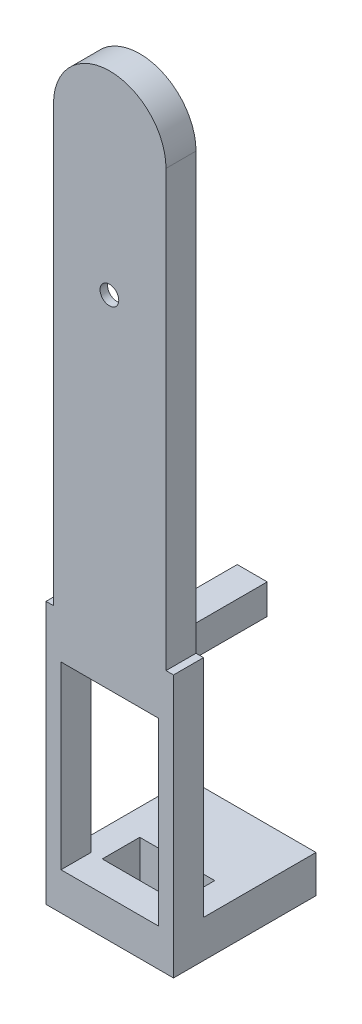
ISO-10303-21;
HEADER;
FILE_DESCRIPTION(('STEP AP214'),'2;1');
FILE_NAME('part.step','',(''),(''),'','','');
FILE_SCHEMA(('AUTOMOTIVE_DESIGN { 1 0 10303 214 1 1 1 1 }'));
ENDSEC;
DATA;
#1=APPLICATION_CONTEXT('core data for automotive mechanical design processes');
#2=APPLICATION_PROTOCOL_DEFINITION('international standard','automotive_design',2000,#1);
#3=PRODUCT_CONTEXT('',#1,'mechanical');
#4=PRODUCT('Part','Part','',(#3));
#5=PRODUCT_RELATED_PRODUCT_CATEGORY('part','',(#4));
#6=PRODUCT_DEFINITION_FORMATION('','',#4);
#7=PRODUCT_DEFINITION_CONTEXT('part definition',#1,'design');
#8=PRODUCT_DEFINITION('design','',#6,#7);
#9=PRODUCT_DEFINITION_SHAPE('','',#8);
#10=(LENGTH_UNIT() NAMED_UNIT(*) SI_UNIT(.MILLI.,.METRE.));
#11=(NAMED_UNIT(*) PLANE_ANGLE_UNIT() SI_UNIT($,.RADIAN.));
#12=(NAMED_UNIT(*) SI_UNIT($,.STERADIAN.) SOLID_ANGLE_UNIT());
#13=UNCERTAINTY_MEASURE_WITH_UNIT(LENGTH_MEASURE(1.E-05),#10,'distance_accuracy_value','');
#14=(GEOMETRIC_REPRESENTATION_CONTEXT(3) GLOBAL_UNCERTAINTY_ASSIGNED_CONTEXT((#13)) GLOBAL_UNIT_ASSIGNED_CONTEXT((#10,
#11,#12)) REPRESENTATION_CONTEXT('',''));
#15=CARTESIAN_POINT('',(0.,0.,0.));
#16=DIRECTION('',(0.,0.,1.));
#17=DIRECTION('',(1.,0.,0.));
#18=AXIS2_PLACEMENT_3D('',#15,#16,#17);
#19=CARTESIAN_POINT('',(0.,58.,0.));
#20=DIRECTION('',(0.,0.,1.));
#21=DIRECTION('',(1.,0.,0.));
#22=AXIS2_PLACEMENT_3D('',#19,#20,#21);
#23=PLANE('',#22);
#24=DIRECTION('',(0.,1.,0.));
#25=VECTOR('',#24,1.);
#26=CARTESIAN_POINT('',(8.50000000000001,0.,0.));
#27=LINE('',#26,#25);
#28=CARTESIAN_POINT('',(8.50000000000001,-30.,0.));
#29=VERTEX_POINT('',#28);
#30=CARTESIAN_POINT('',(8.50000000000001,0.,0.));
#31=VERTEX_POINT('',#30);
#32=EDGE_CURVE('E67',#29,#31,#27,.T.);
#33=ORIENTED_EDGE('',*,*,#32,.F.);
#34=DIRECTION('',(1.,0.,0.));
#35=VECTOR('',#34,1.);
#36=CARTESIAN_POINT('',(0.,-30.,0.));
#37=LINE('',#36,#35);
#38=CARTESIAN_POINT('',(6.50000000000001,-30.,0.));
#39=VERTEX_POINT('',#38);
#40=EDGE_CURVE('E320',#39,#29,#37,.T.);
#41=ORIENTED_EDGE('',*,*,#40,.F.);
#42=DIRECTION('',(0.,1.,0.));
#43=VECTOR('',#42,1.);
#44=CARTESIAN_POINT('',(6.50000000000001,-6.,0.));
#45=LINE('',#44,#43);
#46=CARTESIAN_POINT('',(6.50000000000001,-6.,0.));
#47=VERTEX_POINT('',#46);
#48=EDGE_CURVE('E426',#39,#47,#45,.T.);
#49=ORIENTED_EDGE('',*,*,#48,.T.);
#50=DIRECTION('',(-1.,0.,0.));
#51=VECTOR('',#50,1.);
#52=CARTESIAN_POINT('',(-6.49999999999999,-6.,0.));
#53=LINE('',#52,#51);
#54=CARTESIAN_POINT('',(2.00000000000001,-6.00000000000001,0.));
#55=VERTEX_POINT('',#54);
#56=EDGE_CURVE('E431',#47,#55,#53,.T.);
#57=ORIENTED_EDGE('',*,*,#56,.T.);
#58=DIRECTION('',(0.,1.,0.));
#59=VECTOR('',#58,1.);
#60=CARTESIAN_POINT('',(2.00000000000001,-2.00000000000001,0.));
#61=LINE('',#60,#59);
#62=CARTESIAN_POINT('',(2.00000000000001,-2.00000000000001,0.));
#63=VERTEX_POINT('',#62);
#64=EDGE_CURVE('E378',#55,#63,#61,.T.);
#65=ORIENTED_EDGE('',*,*,#64,.T.);
#66=DIRECTION('',(-1.,0.,0.));
#67=VECTOR('',#66,1.);
#68=CARTESIAN_POINT('',(2.00000000000001,-2.00000000000001,0.));
#69=LINE('',#68,#67);
#70=CARTESIAN_POINT('',(-1.99999999999999,-2.00000000000001,0.));
#71=VERTEX_POINT('',#70);
#72=EDGE_CURVE('E401',#63,#71,#69,.T.);
#73=ORIENTED_EDGE('',*,*,#72,.T.);
#74=DIRECTION('',(0.,-1.,0.));
#75=VECTOR('',#74,1.);
#76=CARTESIAN_POINT('',(-1.99999999999999,-2.00000000000001,0.));
#77=LINE('',#76,#75);
#78=CARTESIAN_POINT('',(-1.99999999999999,-6.,0.));
#79=VERTEX_POINT('',#78);
#80=EDGE_CURVE('E385',#71,#79,#77,.T.);
#81=ORIENTED_EDGE('',*,*,#80,.T.);
#82=CARTESIAN_POINT('',(-6.49999999999999,-6.,0.));
#83=VERTEX_POINT('',#82);
#84=EDGE_CURVE('E430',#79,#83,#53,.T.);
#85=ORIENTED_EDGE('',*,*,#84,.T.);
#86=DIRECTION('',(0.,-1.,0.));
#87=VECTOR('',#86,1.);
#88=CARTESIAN_POINT('',(-6.49999999999999,-6.,0.));
#89=LINE('',#88,#87);
#90=CARTESIAN_POINT('',(-6.49999999999999,-30.,0.));
#91=VERTEX_POINT('',#90);
#92=EDGE_CURVE('E411',#83,#91,#89,.T.);
#93=ORIENTED_EDGE('',*,*,#92,.T.);
#94=DIRECTION('',(1.,0.,0.));
#95=VECTOR('',#94,1.);
#96=CARTESIAN_POINT('',(0.,-30.,0.));
#97=LINE('',#96,#95);
#98=CARTESIAN_POINT('',(-8.49999999999999,-30.,0.));
#99=VERTEX_POINT('',#98);
#100=EDGE_CURVE('E333',#99,#91,#97,.T.);
#101=ORIENTED_EDGE('',*,*,#100,.F.);
#102=DIRECTION('',(0.,-1.,0.));
#103=VECTOR('',#102,1.);
#104=CARTESIAN_POINT('',(-8.49999999999999,0.,0.));
#105=LINE('',#104,#103);
#106=CARTESIAN_POINT('',(-8.49999999999999,0.,0.));
#107=VERTEX_POINT('',#106);
#108=EDGE_CURVE('E489',#107,#99,#105,.T.);
#109=ORIENTED_EDGE('',*,*,#108,.F.);
#110=DIRECTION('',(-1.,0.,0.));
#111=VECTOR('',#110,1.);
#112=CARTESIAN_POINT('',(8.50000000000001,0.,0.));
#113=LINE('',#112,#111);
#114=CARTESIAN_POINT('',(-7.5,0.,0.));
#115=VERTEX_POINT('',#114);
#116=EDGE_CURVE('E484',#115,#107,#113,.T.);
#117=ORIENTED_EDGE('',*,*,#116,.F.);
#118=DIRECTION('',(0.,-1.,0.));
#119=VECTOR('',#118,1.);
#120=CARTESIAN_POINT('',(-7.5,0.,0.));
#121=LINE('',#120,#119);
#122=CARTESIAN_POINT('',(-7.5,58.,0.));
#123=VERTEX_POINT('',#122);
#124=EDGE_CURVE('E514',#123,#115,#121,.T.);
#125=ORIENTED_EDGE('',*,*,#124,.F.);
#126=CARTESIAN_POINT('',(0.,58.,0.));
#127=DIRECTION('',(0.,0.,1.));
#128=DIRECTION('',(1.,0.,0.));
#129=AXIS2_PLACEMENT_3D('',#126,#127,#128);
#130=CIRCLE('',#129,7.5);
#131=CARTESIAN_POINT('',(7.5,58.,0.));
#132=VERTEX_POINT('',#131);
#133=EDGE_CURVE('E523',#132,#123,#130,.T.);
#134=ORIENTED_EDGE('',*,*,#133,.F.);
#135=DIRECTION('',(0.,1.,0.));
#136=VECTOR('',#135,1.);
#137=CARTESIAN_POINT('',(7.5,0.,0.));
#138=LINE('',#137,#136);
#139=CARTESIAN_POINT('',(7.5,0.,0.));
#140=VERTEX_POINT('',#139);
#141=EDGE_CURVE('E509',#140,#132,#138,.T.);
#142=ORIENTED_EDGE('',*,*,#141,.F.);
#143=EDGE_CURVE('E485',#31,#140,#113,.T.);
#144=ORIENTED_EDGE('',*,*,#143,.F.);
#145=EDGE_LOOP('',(#33,#41,#49,#57,#65,#73,#81,#85,#93,#101,#109,#117,#125,#134,#142,#144));
#146=FACE_BOUND('',#145,.T.);
#147=DIRECTION('',(0.143172187649809,-0.989697794623979,0.));
#148=VECTOR('',#147,1.);
#149=CARTESIAN_POINT('',(-5.04981595542474,39.6042352095294,0.));
#150=LINE('',#149,#148);
#151=CARTESIAN_POINT('',(-5.04981595542474,39.6042352095294,0.));
#152=VERTEX_POINT('',#151);
#153=CARTESIAN_POINT('',(-2.47072211778602,21.7758879226761,0.));
#154=VERTEX_POINT('',#153);
#155=EDGE_CURVE('E59',#152,#154,#150,.T.);
#156=ORIENTED_EDGE('',*,*,#155,.T.);
#157=CARTESIAN_POINT('',(-0.200975521021717,22.1042352095293,0.));
#158=DIRECTION('',(0.,0.,-1.));
#159=DIRECTION('',(-1.,0.,0.));
#160=AXIS2_PLACEMENT_3D('',#157,#158,#159);
#161=CIRCLE('',#160,2.29337340054058);
#162=CARTESIAN_POINT('',(2.09239787951886,22.1042352095293,0.));
#163=VERTEX_POINT('',#162);
#164=EDGE_CURVE('E247',#163,#154,#161,.T.);
#165=ORIENTED_EDGE('',*,*,#164,.F.);
#166=DIRECTION('',(-0.161167236733303,-0.986927110684346,0.));
#167=VECTOR('',#166,1.);
#168=CARTESIAN_POINT('',(4.95018404457524,39.6042352095293,0.));
#169=LINE('',#168,#167);
#170=CARTESIAN_POINT('',(4.95018404457524,39.6042352095293,0.));
#171=VERTEX_POINT('',#170);
#172=EDGE_CURVE('E276',#171,#163,#169,.T.);
#173=ORIENTED_EDGE('',*,*,#172,.F.);
#174=DIRECTION('',(0.161684528353419,-0.986842496699008,0.));
#175=VECTOR('',#174,1.);
#176=CARTESIAN_POINT('',(2.08297954573225,57.1042352095293,0.));
#177=LINE('',#176,#175);
#178=CARTESIAN_POINT('',(2.08297954573225,57.1042352095293,0.));
#179=VERTEX_POINT('',#178);
#180=EDGE_CURVE('E280',#179,#171,#177,.T.);
#181=ORIENTED_EDGE('',*,*,#180,.F.);
#182=CARTESIAN_POINT('',(-0.200975521021717,57.1042352095293,0.));
#183=DIRECTION('',(0.,0.,1.));
#184=DIRECTION('',(1.,0.,0.));
#185=AXIS2_PLACEMENT_3D('',#182,#183,#184);
#186=CIRCLE('',#185,2.28395506675397);
#187=CARTESIAN_POINT('',(-2.48493058777569,57.1042352095293,0.));
#188=VERTEX_POINT('',#187);
#189=EDGE_CURVE('E284',#179,#188,#186,.T.);
#190=ORIENTED_EDGE('',*,*,#189,.T.);
#191=DIRECTION('',(0.145015594978954,0.989429369491779,0.));
#192=VECTOR('',#191,1.);
#193=CARTESIAN_POINT('',(-5.04981595542474,39.6042352095294,0.));
#194=LINE('',#193,#192);
#195=EDGE_CURVE('E240',#152,#188,#194,.T.);
#196=ORIENTED_EDGE('',*,*,#195,.F.);
#197=EDGE_LOOP('',(#156,#165,#173,#181,#190,#196));
#198=FACE_BOUND('',#197,.T.);
#199=ADVANCED_FACE('F41',(#146,#198),#23,.F.);
#200=DIRECTION('',(1.,0.,0.));
#201=VECTOR('',#200,1.);
#202=CARTESIAN_POINT('',(-6.49999999999999,-30.,0.));
#203=LINE('',#202,#201);
#204=CARTESIAN_POINT('',(-5.,-30.,0.));
#205=VERTEX_POINT('',#204);
#206=CARTESIAN_POINT('',(5.,-30.,0.));
#207=VERTEX_POINT('',#206);
#208=EDGE_CURVE('E423',#205,#207,#203,.T.);
#209=ORIENTED_EDGE('',*,*,#208,.T.);
#210=DIRECTION('',(0.,-1.,0.));
#211=VECTOR('',#210,1.);
#212=CARTESIAN_POINT('',(5.,-30.,0.));
#213=LINE('',#212,#211);
#214=CARTESIAN_POINT('',(5.,-35.,0.));
#215=VERTEX_POINT('',#214);
#216=EDGE_CURVE('E369',#207,#215,#213,.T.);
#217=ORIENTED_EDGE('',*,*,#216,.T.);
#218=DIRECTION('',(1.,0.,0.));
#219=VECTOR('',#218,1.);
#220=CARTESIAN_POINT('',(8.50000000000001,-35.,0.));
#221=LINE('',#220,#219);
#222=CARTESIAN_POINT('',(-5.,-35.,0.));
#223=VERTEX_POINT('',#222);
#224=EDGE_CURVE('E470',#223,#215,#221,.T.);
#225=ORIENTED_EDGE('',*,*,#224,.F.);
#226=DIRECTION('',(0.,-1.,0.));
#227=VECTOR('',#226,1.);
#228=CARTESIAN_POINT('',(-5.,-30.,0.));
#229=LINE('',#228,#227);
#230=EDGE_CURVE('E357',#205,#223,#229,.T.);
#231=ORIENTED_EDGE('',*,*,#230,.F.);
#232=EDGE_LOOP('',(#209,#217,#225,#231));
#233=FACE_BOUND('',#232,.T.);
#234=ADVANCED_FACE('F636',(#233),#23,.F.);
#235=CARTESIAN_POINT('',(0.,58.,4.));
#236=DIRECTION('',(0.,0.,1.));
#237=DIRECTION('',(1.,0.,0.));
#238=AXIS2_PLACEMENT_3D('',#235,#236,#237);
#239=PLANE('',#238);
#240=CARTESIAN_POINT('',(-0.0498159554247488,39.6042352095293,4.));
#241=DIRECTION('',(0.,0.,1.));
#242=DIRECTION('',(1.,0.,0.));
#243=AXIS2_PLACEMENT_3D('',#240,#241,#242);
#244=CIRCLE('',#243,1.25);
#245=CARTESIAN_POINT('',(1.20018404457525,39.6042352095293,4.));
#246=VERTEX_POINT('',#245);
#247=EDGE_CURVE('E273',#246,#246,#244,.T.);
#248=ORIENTED_EDGE('',*,*,#247,.F.);
#249=EDGE_LOOP('',(#248));
#250=FACE_BOUND('',#249,.T.);
#251=DIRECTION('',(0.,-1.,0.));
#252=VECTOR('',#251,1.);
#253=CARTESIAN_POINT('',(-7.5,0.,4.));
#254=LINE('',#253,#252);
#255=CARTESIAN_POINT('',(-7.5,58.,4.));
#256=VERTEX_POINT('',#255);
#257=CARTESIAN_POINT('',(-7.5,0.,4.));
#258=VERTEX_POINT('',#257);
#259=EDGE_CURVE('E517',#256,#258,#254,.T.);
#260=ORIENTED_EDGE('',*,*,#259,.T.);
#261=DIRECTION('',(-1.,0.,0.));
#262=VECTOR('',#261,1.);
#263=CARTESIAN_POINT('',(8.50000000000001,0.,4.));
#264=LINE('',#263,#262);
#265=CARTESIAN_POINT('',(-8.49999999999999,0.,4.));
#266=VERTEX_POINT('',#265);
#267=EDGE_CURVE('E469',#258,#266,#264,.T.);
#268=ORIENTED_EDGE('',*,*,#267,.T.);
#269=DIRECTION('',(0.,-1.,0.));
#270=VECTOR('',#269,1.);
#271=CARTESIAN_POINT('',(-8.49999999999999,0.,4.));
#272=LINE('',#271,#270);
#273=CARTESIAN_POINT('',(-8.49999999999999,-35.,4.));
#274=VERTEX_POINT('',#273);
#275=EDGE_CURVE('E475',#266,#274,#272,.T.);
#276=ORIENTED_EDGE('',*,*,#275,.T.);
#277=DIRECTION('',(1.,0.,0.));
#278=VECTOR('',#277,1.);
#279=CARTESIAN_POINT('',(8.50000000000001,-35.,4.));
#280=LINE('',#279,#278);
#281=CARTESIAN_POINT('',(8.50000000000001,-35.,4.));
#282=VERTEX_POINT('',#281);
#283=EDGE_CURVE('E478',#274,#282,#280,.T.);
#284=ORIENTED_EDGE('',*,*,#283,.T.);
#285=DIRECTION('',(0.,1.,0.));
#286=VECTOR('',#285,1.);
#287=CARTESIAN_POINT('',(8.50000000000001,0.,4.));
#288=LINE('',#287,#286);
#289=CARTESIAN_POINT('',(8.50000000000001,0.,4.));
#290=VERTEX_POINT('',#289);
#291=EDGE_CURVE('E465',#282,#290,#288,.T.);
#292=ORIENTED_EDGE('',*,*,#291,.T.);
#293=CARTESIAN_POINT('',(7.5,0.,4.));
#294=VERTEX_POINT('',#293);
#295=EDGE_CURVE('E471',#290,#294,#264,.T.);
#296=ORIENTED_EDGE('',*,*,#295,.T.);
#297=DIRECTION('',(0.,1.,0.));
#298=VECTOR('',#297,1.);
#299=CARTESIAN_POINT('',(7.5,0.,4.));
#300=LINE('',#299,#298);
#301=CARTESIAN_POINT('',(7.5,58.,4.));
#302=VERTEX_POINT('',#301);
#303=EDGE_CURVE('E510',#294,#302,#300,.T.);
#304=ORIENTED_EDGE('',*,*,#303,.T.);
#305=CARTESIAN_POINT('',(0.,58.,4.));
#306=DIRECTION('',(0.,0.,1.));
#307=DIRECTION('',(1.,0.,0.));
#308=AXIS2_PLACEMENT_3D('',#305,#306,#307);
#309=CIRCLE('',#308,7.5);
#310=EDGE_CURVE('E513',#302,#256,#309,.T.);
#311=ORIENTED_EDGE('',*,*,#310,.T.);
#312=EDGE_LOOP('',(#260,#268,#276,#284,#292,#296,#304,#311));
#313=FACE_BOUND('',#312,.T.);
#314=DIRECTION('',(-1.,0.,0.));
#315=VECTOR('',#314,1.);
#316=CARTESIAN_POINT('',(0.,-30.,4.));
#317=LINE('',#316,#315);
#318=CARTESIAN_POINT('',(6.50000000000001,-30.,4.));
#319=VERTEX_POINT('',#318);
#320=CARTESIAN_POINT('',(-6.49999999999999,-30.,4.));
#321=VERTEX_POINT('',#320);
#322=EDGE_CURVE('E457',#319,#321,#317,.T.);
#323=ORIENTED_EDGE('',*,*,#322,.T.);
#324=DIRECTION('',(0.,1.,0.));
#325=VECTOR('',#324,1.);
#326=CARTESIAN_POINT('',(-6.5,58.,4.));
#327=LINE('',#326,#325);
#328=CARTESIAN_POINT('',(-6.49999999999999,-6.,4.));
#329=VERTEX_POINT('',#328);
#330=EDGE_CURVE('E461',#321,#329,#327,.T.);
#331=ORIENTED_EDGE('',*,*,#330,.T.);
#332=DIRECTION('',(1.,0.,0.));
#333=VECTOR('',#332,1.);
#334=CARTESIAN_POINT('',(0.,-6.,4.));
#335=LINE('',#334,#333);
#336=CARTESIAN_POINT('',(6.50000000000001,-6.,4.));
#337=VERTEX_POINT('',#336);
#338=EDGE_CURVE('E449',#329,#337,#335,.T.);
#339=ORIENTED_EDGE('',*,*,#338,.T.);
#340=DIRECTION('',(0.,-1.,0.));
#341=VECTOR('',#340,1.);
#342=CARTESIAN_POINT('',(6.5,58.,4.));
#343=LINE('',#342,#341);
#344=EDGE_CURVE('E453',#337,#319,#343,.T.);
#345=ORIENTED_EDGE('',*,*,#344,.T.);
#346=EDGE_LOOP('',(#323,#331,#339,#345));
#347=FACE_BOUND('',#346,.T.);
#348=ADVANCED_FACE('F560',(#250,#313,#347),#239,.T.);
#349=CARTESIAN_POINT('',(7.5,0.,4.));
#350=DIRECTION('',(-1.,0.,0.));
#351=DIRECTION('',(0.,0.,1.));
#352=AXIS2_PLACEMENT_3D('',#349,#350,#351);
#353=PLANE('',#352);
#354=ORIENTED_EDGE('',*,*,#141,.T.);
#355=DIRECTION('',(0.,0.,-1.));
#356=VECTOR('',#355,1.);
#357=CARTESIAN_POINT('',(7.5,58.,4.));
#358=LINE('',#357,#356);
#359=EDGE_CURVE('E535',#302,#132,#358,.T.);
#360=ORIENTED_EDGE('',*,*,#359,.F.);
#361=ORIENTED_EDGE('',*,*,#303,.F.);
#362=DIRECTION('',(0.,0.,-1.));
#363=VECTOR('',#362,1.);
#364=CARTESIAN_POINT('',(7.5,0.,4.));
#365=LINE('',#364,#363);
#366=EDGE_CURVE('E51',#294,#140,#365,.T.);
#367=ORIENTED_EDGE('',*,*,#366,.T.);
#368=EDGE_LOOP('',(#354,#360,#361,#367));
#369=FACE_BOUND('',#368,.T.);
#370=ADVANCED_FACE('F43',(#369),#353,.F.);
#371=CARTESIAN_POINT('',(0.,58.,4.));
#372=DIRECTION('',(0.,0.,-1.));
#373=DIRECTION('',(-1.,0.,0.));
#374=AXIS2_PLACEMENT_3D('',#371,#372,#373);
#375=CYLINDRICAL_SURFACE('',#374,7.5);
#376=ORIENTED_EDGE('',*,*,#133,.T.);
#377=DIRECTION('',(0.,0.,-1.));
#378=VECTOR('',#377,1.);
#379=CARTESIAN_POINT('',(-7.5,58.,4.));
#380=LINE('',#379,#378);
#381=EDGE_CURVE('E531',#256,#123,#380,.T.);
#382=ORIENTED_EDGE('',*,*,#381,.F.);
#383=ORIENTED_EDGE('',*,*,#310,.F.);
#384=ORIENTED_EDGE('',*,*,#359,.T.);
#385=EDGE_LOOP('',(#376,#382,#383,#384));
#386=FACE_BOUND('',#385,.T.);
#387=ADVANCED_FACE('F552',(#386),#375,.T.);
#388=CARTESIAN_POINT('',(-7.5,0.,4.));
#389=DIRECTION('',(1.,0.,0.));
#390=DIRECTION('',(0.,0.,-1.));
#391=AXIS2_PLACEMENT_3D('',#388,#389,#390);
#392=PLANE('',#391);
#393=ORIENTED_EDGE('',*,*,#124,.T.);
#394=DIRECTION('',(0.,0.,-1.));
#395=VECTOR('',#394,1.);
#396=CARTESIAN_POINT('',(-7.5,0.,4.));
#397=LINE('',#396,#395);
#398=EDGE_CURVE('E520',#258,#115,#397,.T.);
#399=ORIENTED_EDGE('',*,*,#398,.F.);
#400=ORIENTED_EDGE('',*,*,#259,.F.);
#401=ORIENTED_EDGE('',*,*,#381,.T.);
#402=EDGE_LOOP('',(#393,#399,#400,#401));
#403=FACE_BOUND('',#402,.T.);
#404=ADVANCED_FACE('F556',(#403),#392,.F.);
#405=CARTESIAN_POINT('',(8.50000000000001,0.,4.));
#406=DIRECTION('',(0.,-1.,0.));
#407=DIRECTION('',(1.,0.,0.));
#408=AXIS2_PLACEMENT_3D('',#405,#406,#407);
#409=PLANE('',#408);
#410=ORIENTED_EDGE('',*,*,#267,.F.);
#411=ORIENTED_EDGE('',*,*,#398,.T.);
#412=ORIENTED_EDGE('',*,*,#116,.T.);
#413=DIRECTION('',(0.,0.,-1.));
#414=VECTOR('',#413,1.);
#415=CARTESIAN_POINT('',(-8.49999999999999,0.,4.));
#416=LINE('',#415,#414);
#417=EDGE_CURVE('E501',#266,#107,#416,.T.);
#418=ORIENTED_EDGE('',*,*,#417,.F.);
#419=EDGE_LOOP('',(#410,#411,#412,#418));
#420=FACE_BOUND('',#419,.T.);
#421=ADVANCED_FACE('F602',(#420),#409,.F.);
#422=CARTESIAN_POINT('',(8.50000000000001,0.,4.));
#423=DIRECTION('',(-1.,0.,0.));
#424=DIRECTION('',(0.,-1.,0.));
#425=AXIS2_PLACEMENT_3D('',#422,#423,#424);
#426=PLANE('',#425);
#427=DIRECTION('',(0.,0.,-1.));
#428=VECTOR('',#427,1.);
#429=CARTESIAN_POINT('',(8.50000000000001,-35.,4.));
#430=LINE('',#429,#428);
#431=CARTESIAN_POINT('',(8.50000000000001,-35.,-15.));
#432=VERTEX_POINT('',#431);
#433=EDGE_CURVE('E481',#282,#432,#430,.T.);
#434=ORIENTED_EDGE('',*,*,#433,.T.);
#435=DIRECTION('',(0.,-1.,0.));
#436=VECTOR('',#435,1.);
#437=CARTESIAN_POINT('',(8.50000000000001,-30.,-15.));
#438=LINE('',#437,#436);
#439=CARTESIAN_POINT('',(8.50000000000001,-30.,-15.));
#440=VERTEX_POINT('',#439);
#441=EDGE_CURVE('E365',#440,#432,#438,.T.);
#442=ORIENTED_EDGE('',*,*,#441,.F.);
#443=DIRECTION('',(0.,0.,-1.));
#444=VECTOR('',#443,1.);
#445=CARTESIAN_POINT('',(8.50000000000001,-30.,0.));
#446=LINE('',#445,#444);
#447=EDGE_CURVE('E323',#29,#440,#446,.T.);
#448=ORIENTED_EDGE('',*,*,#447,.F.);
#449=ORIENTED_EDGE('',*,*,#32,.T.);
#450=DIRECTION('',(0.,0.,-1.));
#451=VECTOR('',#450,1.);
#452=CARTESIAN_POINT('',(8.50000000000001,0.,4.));
#453=LINE('',#452,#451);
#454=EDGE_CURVE('E505',#290,#31,#453,.T.);
#455=ORIENTED_EDGE('',*,*,#454,.F.);
#456=ORIENTED_EDGE('',*,*,#291,.F.);
#457=EDGE_LOOP('',(#434,#442,#448,#449,#455,#456));
#458=FACE_BOUND('',#457,.T.);
#459=ADVANCED_FACE('F567',(#458),#426,.F.);
#460=ORIENTED_EDGE('',*,*,#366,.F.);
#461=ORIENTED_EDGE('',*,*,#295,.F.);
#462=ORIENTED_EDGE('',*,*,#454,.T.);
#463=ORIENTED_EDGE('',*,*,#143,.T.);
#464=EDGE_LOOP('',(#460,#461,#462,#463));
#465=FACE_BOUND('',#464,.T.);
#466=ADVANCED_FACE('F544',(#465),#409,.F.);
#467=CARTESIAN_POINT('',(-8.49999999999999,0.,4.));
#468=DIRECTION('',(1.,0.,0.));
#469=DIRECTION('',(0.,1.,0.));
#470=AXIS2_PLACEMENT_3D('',#467,#468,#469);
#471=PLANE('',#470);
#472=ORIENTED_EDGE('',*,*,#108,.T.);
#473=DIRECTION('',(0.,0.,1.));
#474=VECTOR('',#473,1.);
#475=CARTESIAN_POINT('',(-8.50000000000001,-30.,0.));
#476=LINE('',#475,#474);
#477=CARTESIAN_POINT('',(-8.50000000000001,-30.,-15.));
#478=VERTEX_POINT('',#477);
#479=EDGE_CURVE('E329',#478,#99,#476,.T.);
#480=ORIENTED_EDGE('',*,*,#479,.F.);
#481=DIRECTION('',(0.,-1.,0.));
#482=VECTOR('',#481,1.);
#483=CARTESIAN_POINT('',(-8.50000000000001,-30.,-15.));
#484=LINE('',#483,#482);
#485=CARTESIAN_POINT('',(-8.50000000000001,-35.,-15.));
#486=VERTEX_POINT('',#485);
#487=EDGE_CURVE('E361',#478,#486,#484,.T.);
#488=ORIENTED_EDGE('',*,*,#487,.T.);
#489=DIRECTION('',(0.,0.,-1.));
#490=VECTOR('',#489,1.);
#491=CARTESIAN_POINT('',(-8.49999999999999,-35.,4.));
#492=LINE('',#491,#490);
#493=EDGE_CURVE('E498',#274,#486,#492,.T.);
#494=ORIENTED_EDGE('',*,*,#493,.F.);
#495=ORIENTED_EDGE('',*,*,#275,.F.);
#496=ORIENTED_EDGE('',*,*,#417,.T.);
#497=EDGE_LOOP('',(#472,#480,#488,#494,#495,#496));
#498=FACE_BOUND('',#497,.T.);
#499=ADVANCED_FACE('F606',(#498),#471,.F.);
#500=CARTESIAN_POINT('',(8.50000000000001,-35.,4.));
#501=DIRECTION('',(0.,1.,0.));
#502=DIRECTION('',(0.,0.,1.));
#503=AXIS2_PLACEMENT_3D('',#500,#501,#502);
#504=PLANE('',#503);
#505=DIRECTION('',(-1.,0.,0.));
#506=VECTOR('',#505,1.);
#507=CARTESIAN_POINT('',(0.,-35.,-15.));
#508=LINE('',#507,#506);
#509=EDGE_CURVE('E348',#432,#486,#508,.T.);
#510=ORIENTED_EDGE('',*,*,#509,.F.);
#511=ORIENTED_EDGE('',*,*,#433,.F.);
#512=ORIENTED_EDGE('',*,*,#283,.F.);
#513=ORIENTED_EDGE('',*,*,#493,.T.);
#514=EDGE_LOOP('',(#510,#511,#512,#513));
#515=FACE_BOUND('',#514,.T.);
#516=ORIENTED_EDGE('',*,*,#224,.T.);
#517=DIRECTION('',(0.,0.,-1.));
#518=VECTOR('',#517,1.);
#519=CARTESIAN_POINT('',(5.,-35.,0.));
#520=LINE('',#519,#518);
#521=CARTESIAN_POINT('',(5.,-35.,-5.));
#522=VERTEX_POINT('',#521);
#523=EDGE_CURVE('E344',#215,#522,#520,.T.);
#524=ORIENTED_EDGE('',*,*,#523,.T.);
#525=DIRECTION('',(1.,0.,0.));
#526=VECTOR('',#525,1.);
#527=CARTESIAN_POINT('',(0.,-35.,-5.));
#528=LINE('',#527,#526);
#529=CARTESIAN_POINT('',(-5.,-35.,-5.));
#530=VERTEX_POINT('',#529);
#531=EDGE_CURVE('E311',#530,#522,#528,.T.);
#532=ORIENTED_EDGE('',*,*,#531,.F.);
#533=DIRECTION('',(0.,0.,-1.));
#534=VECTOR('',#533,1.);
#535=CARTESIAN_POINT('',(-5.,-35.,0.));
#536=LINE('',#535,#534);
#537=EDGE_CURVE('E316',#223,#530,#536,.T.);
#538=ORIENTED_EDGE('',*,*,#537,.F.);
#539=EDGE_LOOP('',(#516,#524,#532,#538));
#540=FACE_BOUND('',#539,.T.);
#541=ADVANCED_FACE('F614',(#515,#540),#504,.F.);
#542=CARTESIAN_POINT('',(-6.49999999999999,-6.,12.1));
#543=DIRECTION('',(1.,0.,0.));
#544=DIRECTION('',(0.,1.,0.));
#545=AXIS2_PLACEMENT_3D('',#542,#543,#544);
#546=PLANE('',#545);
#547=DIRECTION('',(0.,0.,-1.));
#548=VECTOR('',#547,1.);
#549=CARTESIAN_POINT('',(-6.49999999999999,-30.,12.1));
#550=LINE('',#549,#548);
#551=EDGE_CURVE('E446',#321,#91,#550,.T.);
#552=ORIENTED_EDGE('',*,*,#551,.T.);
#553=ORIENTED_EDGE('',*,*,#92,.F.);
#554=DIRECTION('',(0.,0.,-1.));
#555=VECTOR('',#554,1.);
#556=CARTESIAN_POINT('',(-6.49999999999999,-6.,12.1));
#557=LINE('',#556,#555);
#558=EDGE_CURVE('E435',#329,#83,#557,.T.);
#559=ORIENTED_EDGE('',*,*,#558,.F.);
#560=ORIENTED_EDGE('',*,*,#330,.F.);
#561=EDGE_LOOP('',(#552,#553,#559,#560));
#562=FACE_BOUND('',#561,.T.);
#563=ADVANCED_FACE('F617',(#562),#546,.T.);
#564=CARTESIAN_POINT('',(-6.49999999999999,-30.,12.1));
#565=DIRECTION('',(0.,1.,0.));
#566=DIRECTION('',(0.,0.,1.));
#567=AXIS2_PLACEMENT_3D('',#564,#565,#566);
#568=PLANE('',#567);
#569=DIRECTION('',(0.,0.,-1.));
#570=VECTOR('',#569,1.);
#571=CARTESIAN_POINT('',(6.50000000000001,-30.,12.1));
#572=LINE('',#571,#570);
#573=EDGE_CURVE('E442',#319,#39,#572,.T.);
#574=ORIENTED_EDGE('',*,*,#573,.T.);
#575=ORIENTED_EDGE('',*,*,#40,.T.);
#576=ORIENTED_EDGE('',*,*,#447,.T.);
#577=DIRECTION('',(-1.,0.,0.));
#578=VECTOR('',#577,1.);
#579=CARTESIAN_POINT('',(0.,-30.,-15.));
#580=LINE('',#579,#578);
#581=EDGE_CURVE('E326',#440,#478,#580,.T.);
#582=ORIENTED_EDGE('',*,*,#581,.T.);
#583=ORIENTED_EDGE('',*,*,#479,.T.);
#584=ORIENTED_EDGE('',*,*,#100,.T.);
#585=ORIENTED_EDGE('',*,*,#551,.F.);
#586=ORIENTED_EDGE('',*,*,#322,.F.);
#587=EDGE_LOOP('',(#574,#575,#576,#582,#583,#584,#585,#586));
#588=FACE_BOUND('',#587,.T.);
#589=DIRECTION('',(0.,0.,-1.));
#590=VECTOR('',#589,1.);
#591=CARTESIAN_POINT('',(5.,-30.,0.));
#592=LINE('',#591,#590);
#593=CARTESIAN_POINT('',(5.,-30.,-5.));
#594=VERTEX_POINT('',#593);
#595=EDGE_CURVE('E315',#207,#594,#592,.T.);
#596=ORIENTED_EDGE('',*,*,#595,.F.);
#597=ORIENTED_EDGE('',*,*,#208,.F.);
#598=DIRECTION('',(0.,0.,-1.));
#599=VECTOR('',#598,1.);
#600=CARTESIAN_POINT('',(-5.,-30.,0.));
#601=LINE('',#600,#599);
#602=CARTESIAN_POINT('',(-5.,-30.,-5.));
#603=VERTEX_POINT('',#602);
#604=EDGE_CURVE('E337',#205,#603,#601,.T.);
#605=ORIENTED_EDGE('',*,*,#604,.T.);
#606=DIRECTION('',(1.,0.,0.));
#607=VECTOR('',#606,1.);
#608=CARTESIAN_POINT('',(0.,-30.,-5.));
#609=LINE('',#608,#607);
#610=EDGE_CURVE('E312',#603,#594,#609,.T.);
#611=ORIENTED_EDGE('',*,*,#610,.T.);
#612=EDGE_LOOP('',(#596,#597,#605,#611));
#613=FACE_BOUND('',#612,.T.);
#614=ADVANCED_FACE('F572',(#588,#613),#568,.T.);
#615=CARTESIAN_POINT('',(6.50000000000001,-6.,12.1));
#616=DIRECTION('',(-1.,0.,0.));
#617=DIRECTION('',(0.,-1.,0.));
#618=AXIS2_PLACEMENT_3D('',#615,#616,#617);
#619=PLANE('',#618);
#620=DIRECTION('',(0.,0.,-1.));
#621=VECTOR('',#620,1.);
#622=CARTESIAN_POINT('',(6.50000000000001,-6.,12.1));
#623=LINE('',#622,#621);
#624=EDGE_CURVE('E439',#337,#47,#623,.T.);
#625=ORIENTED_EDGE('',*,*,#624,.T.);
#626=ORIENTED_EDGE('',*,*,#48,.F.);
#627=ORIENTED_EDGE('',*,*,#573,.F.);
#628=ORIENTED_EDGE('',*,*,#344,.F.);
#629=EDGE_LOOP('',(#625,#626,#627,#628));
#630=FACE_BOUND('',#629,.T.);
#631=ADVANCED_FACE('F578',(#630),#619,.T.);
#632=CARTESIAN_POINT('',(-6.49999999999999,-6.,12.1));
#633=DIRECTION('',(0.,-1.,0.));
#634=DIRECTION('',(0.,0.,-1.));
#635=AXIS2_PLACEMENT_3D('',#632,#633,#634);
#636=PLANE('',#635);
#637=ORIENTED_EDGE('',*,*,#558,.T.);
#638=ORIENTED_EDGE('',*,*,#84,.F.);
#639=DIRECTION('',(0.,0.,1.));
#640=VECTOR('',#639,1.);
#641=CARTESIAN_POINT('',(-1.99999999999999,-6.00000000000001,-15.));
#642=LINE('',#641,#640);
#643=CARTESIAN_POINT('',(-1.99999999999999,-6.00000000000001,-15.));
#644=VERTEX_POINT('',#643);
#645=EDGE_CURVE('E412',#644,#79,#642,.T.);
#646=ORIENTED_EDGE('',*,*,#645,.F.);
#647=DIRECTION('',(1.,0.,0.));
#648=VECTOR('',#647,1.);
#649=CARTESIAN_POINT('',(2.00000000000001,-6.00000000000001,-15.));
#650=LINE('',#649,#648);
#651=CARTESIAN_POINT('',(2.00000000000001,-6.00000000000001,-15.));
#652=VERTEX_POINT('',#651);
#653=EDGE_CURVE('E393',#644,#652,#650,.T.);
#654=ORIENTED_EDGE('',*,*,#653,.T.);
#655=DIRECTION('',(0.,0.,1.));
#656=VECTOR('',#655,1.);
#657=CARTESIAN_POINT('',(2.00000000000001,-6.00000000000001,-15.));
#658=LINE('',#657,#656);
#659=EDGE_CURVE('E408',#652,#55,#658,.T.);
#660=ORIENTED_EDGE('',*,*,#659,.T.);
#661=ORIENTED_EDGE('',*,*,#56,.F.);
#662=ORIENTED_EDGE('',*,*,#624,.F.);
#663=ORIENTED_EDGE('',*,*,#338,.F.);
#664=EDGE_LOOP('',(#637,#638,#646,#654,#660,#661,#662,#663));
#665=FACE_BOUND('',#664,.T.);
#666=ADVANCED_FACE('F581',(#665),#636,.T.);
#667=CARTESIAN_POINT('',(2.00000000000001,-2.00000000000001,-15.));
#668=DIRECTION('',(1.,0.,0.));
#669=DIRECTION('',(0.,1.,0.));
#670=AXIS2_PLACEMENT_3D('',#667,#668,#669);
#671=PLANE('',#670);
#672=ORIENTED_EDGE('',*,*,#64,.F.);
#673=ORIENTED_EDGE('',*,*,#659,.F.);
#674=DIRECTION('',(0.,1.,0.));
#675=VECTOR('',#674,1.);
#676=CARTESIAN_POINT('',(2.00000000000001,-2.00000000000001,-15.));
#677=LINE('',#676,#675);
#678=CARTESIAN_POINT('',(2.00000000000001,-2.00000000000001,-15.));
#679=VERTEX_POINT('',#678);
#680=EDGE_CURVE('E380',#652,#679,#677,.T.);
#681=ORIENTED_EDGE('',*,*,#680,.T.);
#682=DIRECTION('',(0.,0.,1.));
#683=VECTOR('',#682,1.);
#684=CARTESIAN_POINT('',(2.00000000000001,-2.00000000000001,-15.));
#685=LINE('',#684,#683);
#686=EDGE_CURVE('E397',#679,#63,#685,.T.);
#687=ORIENTED_EDGE('',*,*,#686,.T.);
#688=EDGE_LOOP('',(#672,#673,#681,#687));
#689=FACE_BOUND('',#688,.T.);
#690=ADVANCED_FACE('F586',(#689),#671,.T.);
#691=CARTESIAN_POINT('',(-1.99999999999999,-2.00000000000001,-15.));
#692=DIRECTION('',(-1.,0.,0.));
#693=DIRECTION('',(0.,-1.,0.));
#694=AXIS2_PLACEMENT_3D('',#691,#692,#693);
#695=PLANE('',#694);
#696=ORIENTED_EDGE('',*,*,#80,.F.);
#697=DIRECTION('',(0.,0.,1.));
#698=VECTOR('',#697,1.);
#699=CARTESIAN_POINT('',(-1.99999999999999,-2.00000000000001,-15.));
#700=LINE('',#699,#698);
#701=CARTESIAN_POINT('',(-1.99999999999999,-2.00000000000001,-15.));
#702=VERTEX_POINT('',#701);
#703=EDGE_CURVE('E415',#702,#71,#700,.T.);
#704=ORIENTED_EDGE('',*,*,#703,.F.);
#705=DIRECTION('',(0.,-1.,0.));
#706=VECTOR('',#705,1.);
#707=CARTESIAN_POINT('',(-1.99999999999999,-2.00000000000001,-15.));
#708=LINE('',#707,#706);
#709=EDGE_CURVE('E389',#702,#644,#708,.T.);
#710=ORIENTED_EDGE('',*,*,#709,.T.);
#711=ORIENTED_EDGE('',*,*,#645,.T.);
#712=EDGE_LOOP('',(#696,#704,#710,#711));
#713=FACE_BOUND('',#712,.T.);
#714=ADVANCED_FACE('F595',(#713),#695,.T.);
#715=CARTESIAN_POINT('',(2.00000000000001,-2.00000000000001,-15.));
#716=DIRECTION('',(0.,1.,0.));
#717=DIRECTION('',(-1.,0.,0.));
#718=AXIS2_PLACEMENT_3D('',#715,#716,#717);
#719=PLANE('',#718);
#720=ORIENTED_EDGE('',*,*,#72,.F.);
#721=ORIENTED_EDGE('',*,*,#686,.F.);
#722=DIRECTION('',(-1.,0.,0.));
#723=VECTOR('',#722,1.);
#724=CARTESIAN_POINT('',(2.00000000000001,-2.00000000000001,-15.));
#725=LINE('',#724,#723);
#726=EDGE_CURVE('E384',#679,#702,#725,.T.);
#727=ORIENTED_EDGE('',*,*,#726,.T.);
#728=ORIENTED_EDGE('',*,*,#703,.T.);
#729=EDGE_LOOP('',(#720,#721,#727,#728));
#730=FACE_BOUND('',#729,.T.);
#731=ADVANCED_FACE('F591',(#730),#719,.T.);
#732=CARTESIAN_POINT('',(0.,0.,-15.));
#733=DIRECTION('',(0.,0.,-1.));
#734=DIRECTION('',(-1.,0.,0.));
#735=AXIS2_PLACEMENT_3D('',#732,#733,#734);
#736=PLANE('',#735);
#737=CARTESIAN_POINT('',(0.,-4.00000000000001,-15.));
#738=DIRECTION('',(0.,0.,1.));
#739=DIRECTION('',(1.,0.,0.));
#740=AXIS2_PLACEMENT_3D('',#737,#738,#739);
#741=CIRCLE('',#740,1.175);
#742=CARTESIAN_POINT('',(1.17500000000001,-4.00000000000001,-15.));
#743=VERTEX_POINT('',#742);
#744=EDGE_CURVE('E375',#743,#743,#741,.T.);
#745=ORIENTED_EDGE('',*,*,#744,.T.);
#746=EDGE_LOOP('',(#745));
#747=FACE_BOUND('',#746,.T.);
#748=ORIENTED_EDGE('',*,*,#680,.F.);
#749=ORIENTED_EDGE('',*,*,#653,.F.);
#750=ORIENTED_EDGE('',*,*,#709,.F.);
#751=ORIENTED_EDGE('',*,*,#726,.F.);
#752=EDGE_LOOP('',(#748,#749,#750,#751));
#753=FACE_BOUND('',#752,.T.);
#754=ADVANCED_FACE('F663',(#747,#753),#736,.T.);
#755=CARTESIAN_POINT('',(0.,-4.00000000000001,-15.));
#756=DIRECTION('',(0.,0.,1.));
#757=DIRECTION('',(1.,0.,0.));
#758=AXIS2_PLACEMENT_3D('',#755,#756,#757);
#759=CYLINDRICAL_SURFACE('',#758,1.175);
#760=ORIENTED_EDGE('',*,*,#744,.F.);
#761=EDGE_LOOP('',(#760));
#762=FACE_BOUND('',#761,.T.);
#763=CARTESIAN_POINT('',(0.,-4.00000000000001,0.));
#764=DIRECTION('',(0.,0.,1.));
#765=DIRECTION('',(1.,0.,0.));
#766=AXIS2_PLACEMENT_3D('',#763,#764,#765);
#767=CIRCLE('',#766,1.175);
#768=CARTESIAN_POINT('',(1.17500000000001,-4.00000000000001,0.));
#769=VERTEX_POINT('',#768);
#770=EDGE_CURVE('E11',#769,#769,#767,.T.);
#771=ORIENTED_EDGE('',*,*,#770,.T.);
#772=EDGE_LOOP('',(#771));
#773=FACE_BOUND('',#772,.T.);
#774=ADVANCED_FACE('F655',(#762,#773),#759,.F.);
#775=ORIENTED_EDGE('',*,*,#770,.F.);
#776=EDGE_LOOP('',(#775));
#777=FACE_BOUND('',#776,.T.);
#778=ADVANCED_FACE('F648',(#777),#23,.F.);
#779=CARTESIAN_POINT('',(0.,-30.,-5.));
#780=DIRECTION('',(0.,0.,-1.));
#781=DIRECTION('',(-1.,0.,0.));
#782=AXIS2_PLACEMENT_3D('',#779,#780,#781);
#783=PLANE('',#782);
#784=CARTESIAN_POINT('',(0.,-32.5,-5.));
#785=DIRECTION('',(0.,0.,-1.));
#786=DIRECTION('',(-1.,0.,0.));
#787=AXIS2_PLACEMENT_3D('',#784,#785,#786);
#788=CIRCLE('',#787,1.175);
#789=CARTESIAN_POINT('',(-1.175,-32.5,-5.));
#790=VERTEX_POINT('',#789);
#791=EDGE_CURVE('E307',#790,#790,#788,.T.);
#792=ORIENTED_EDGE('',*,*,#791,.T.);
#793=EDGE_LOOP('',(#792));
#794=FACE_BOUND('',#793,.T.);
#795=ORIENTED_EDGE('',*,*,#531,.T.);
#796=DIRECTION('',(0.,-1.,0.));
#797=VECTOR('',#796,1.);
#798=CARTESIAN_POINT('',(5.,-30.,-5.));
#799=LINE('',#798,#797);
#800=EDGE_CURVE('E372',#594,#522,#799,.T.);
#801=ORIENTED_EDGE('',*,*,#800,.F.);
#802=ORIENTED_EDGE('',*,*,#610,.F.);
#803=DIRECTION('',(0.,-1.,0.));
#804=VECTOR('',#803,1.);
#805=CARTESIAN_POINT('',(-5.,-30.,-5.));
#806=LINE('',#805,#804);
#807=EDGE_CURVE('E340',#603,#530,#806,.T.);
#808=ORIENTED_EDGE('',*,*,#807,.T.);
#809=EDGE_LOOP('',(#795,#801,#802,#808));
#810=FACE_BOUND('',#809,.T.);
#811=ADVANCED_FACE('F631',(#794,#810),#783,.F.);
#812=CARTESIAN_POINT('',(5.,-30.,0.));
#813=DIRECTION('',(-1.,0.,0.));
#814=DIRECTION('',(0.,0.,1.));
#815=AXIS2_PLACEMENT_3D('',#812,#813,#814);
#816=PLANE('',#815);
#817=ORIENTED_EDGE('',*,*,#523,.F.);
#818=ORIENTED_EDGE('',*,*,#216,.F.);
#819=ORIENTED_EDGE('',*,*,#595,.T.);
#820=ORIENTED_EDGE('',*,*,#800,.T.);
#821=EDGE_LOOP('',(#817,#818,#819,#820));
#822=FACE_BOUND('',#821,.T.);
#823=ADVANCED_FACE('F626',(#822),#816,.T.);
#824=CARTESIAN_POINT('',(0.,-30.,-15.));
#825=DIRECTION('',(0.,0.,1.));
#826=DIRECTION('',(1.,0.,0.));
#827=AXIS2_PLACEMENT_3D('',#824,#825,#826);
#828=PLANE('',#827);
#829=CARTESIAN_POINT('',(0.,-32.5,-15.));
#830=DIRECTION('',(0.,0.,-1.));
#831=DIRECTION('',(-1.,0.,0.));
#832=AXIS2_PLACEMENT_3D('',#829,#830,#831);
#833=CIRCLE('',#832,1.175);
#834=CARTESIAN_POINT('',(-1.175,-32.5,-15.));
#835=VERTEX_POINT('',#834);
#836=EDGE_CURVE('E249',#835,#835,#833,.T.);
#837=ORIENTED_EDGE('',*,*,#836,.F.);
#838=EDGE_LOOP('',(#837));
#839=FACE_BOUND('',#838,.T.);
#840=ORIENTED_EDGE('',*,*,#509,.T.);
#841=ORIENTED_EDGE('',*,*,#487,.F.);
#842=ORIENTED_EDGE('',*,*,#581,.F.);
#843=ORIENTED_EDGE('',*,*,#441,.T.);
#844=EDGE_LOOP('',(#840,#841,#842,#843));
#845=FACE_BOUND('',#844,.T.);
#846=ADVANCED_FACE('F611',(#839,#845),#828,.F.);
#847=CARTESIAN_POINT('',(-5.,-30.,0.));
#848=DIRECTION('',(-1.,0.,0.));
#849=DIRECTION('',(0.,0.,1.));
#850=AXIS2_PLACEMENT_3D('',#847,#848,#849);
#851=PLANE('',#850);
#852=ORIENTED_EDGE('',*,*,#537,.T.);
#853=ORIENTED_EDGE('',*,*,#807,.F.);
#854=ORIENTED_EDGE('',*,*,#604,.F.);
#855=ORIENTED_EDGE('',*,*,#230,.T.);
#856=EDGE_LOOP('',(#852,#853,#854,#855));
#857=FACE_BOUND('',#856,.T.);
#858=ADVANCED_FACE('F635',(#857),#851,.F.);
#859=CARTESIAN_POINT('',(0.,-32.5,-2.3));
#860=DIRECTION('',(0.,0.,-1.));
#861=DIRECTION('',(-1.,0.,0.));
#862=AXIS2_PLACEMENT_3D('',#859,#860,#861);
#863=CYLINDRICAL_SURFACE('',#862,1.175);
#864=ORIENTED_EDGE('',*,*,#836,.T.);
#865=EDGE_LOOP('',(#864));
#866=FACE_BOUND('',#865,.T.);
#867=ORIENTED_EDGE('',*,*,#791,.F.);
#868=EDGE_LOOP('',(#867));
#869=FACE_BOUND('',#868,.T.);
#870=ADVANCED_FACE('F779',(#866,#869),#863,.F.);
#871=CARTESIAN_POINT('',(-5.04981595542474,39.6042352095294,3.));
#872=DIRECTION('',(0.989697794623979,0.143172187649809,0.));
#873=DIRECTION('',(-0.143172187649809,0.989697794623979,0.));
#874=AXIS2_PLACEMENT_3D('',#871,#872,#873);
#875=PLANE('',#874);
#876=ORIENTED_EDGE('',*,*,#155,.F.);
#877=DIRECTION('',(0.,0.,-1.));
#878=VECTOR('',#877,1.);
#879=CARTESIAN_POINT('',(-5.04981595542474,39.6042352095294,3.));
#880=LINE('',#879,#878);
#881=CARTESIAN_POINT('',(-5.04981595542474,39.6042352095294,3.));
#882=VERTEX_POINT('',#881);
#883=EDGE_CURVE('E233',#882,#152,#880,.T.);
#884=ORIENTED_EDGE('',*,*,#883,.F.);
#885=DIRECTION('',(0.143172187649809,-0.989697794623979,0.));
#886=VECTOR('',#885,1.);
#887=CARTESIAN_POINT('',(-5.04981595542474,39.6042352095294,3.));
#888=LINE('',#887,#886);
#889=CARTESIAN_POINT('',(-2.47072211778602,21.7758879226761,3.));
#890=VERTEX_POINT('',#889);
#891=EDGE_CURVE('E228',#882,#890,#888,.T.);
#892=ORIENTED_EDGE('',*,*,#891,.T.);
#893=DIRECTION('',(0.,0.,-1.));
#894=VECTOR('',#893,1.);
#895=CARTESIAN_POINT('',(-2.47072211778602,21.7758879226761,3.));
#896=LINE('',#895,#894);
#897=EDGE_CURVE('E231',#890,#154,#896,.T.);
#898=ORIENTED_EDGE('',*,*,#897,.T.);
#899=EDGE_LOOP('',(#876,#884,#892,#898));
#900=FACE_BOUND('',#899,.T.);
#901=ADVANCED_FACE('F230',(#900),#875,.T.);
#902=CARTESIAN_POINT('',(-0.200975521021717,22.1042352095293,3.));
#903=DIRECTION('',(0.,0.,-1.));
#904=DIRECTION('',(-1.,0.,0.));
#905=AXIS2_PLACEMENT_3D('',#902,#903,#904);
#906=CYLINDRICAL_SURFACE('',#905,2.29337340054058);
#907=ORIENTED_EDGE('',*,*,#164,.T.);
#908=ORIENTED_EDGE('',*,*,#897,.F.);
#909=CARTESIAN_POINT('',(-0.200975521021717,22.1042352095293,3.));
#910=DIRECTION('',(0.,0.,-1.));
#911=DIRECTION('',(-1.,0.,0.));
#912=AXIS2_PLACEMENT_3D('',#909,#910,#911);
#913=CIRCLE('',#912,2.29337340054058);
#914=CARTESIAN_POINT('',(2.09239787951886,22.1042352095293,3.));
#915=VERTEX_POINT('',#914);
#916=EDGE_CURVE('E239',#915,#890,#913,.T.);
#917=ORIENTED_EDGE('',*,*,#916,.F.);
#918=DIRECTION('',(0.,0.,-1.));
#919=VECTOR('',#918,1.);
#920=CARTESIAN_POINT('',(2.09239787951886,22.1042352095293,3.));
#921=LINE('',#920,#919);
#922=EDGE_CURVE('E250',#915,#163,#921,.T.);
#923=ORIENTED_EDGE('',*,*,#922,.T.);
#924=EDGE_LOOP('',(#907,#908,#917,#923));
#925=FACE_BOUND('',#924,.T.);
#926=ADVANCED_FACE('F244',(#925),#906,.F.);
#927=CARTESIAN_POINT('',(4.95018404457524,39.6042352095293,3.));
#928=DIRECTION('',(0.986927110684346,-0.161167236733303,0.));
#929=DIRECTION('',(0.161167236733303,0.986927110684346,0.));
#930=AXIS2_PLACEMENT_3D('',#927,#928,#929);
#931=PLANE('',#930);
#932=ORIENTED_EDGE('',*,*,#172,.T.);
#933=ORIENTED_EDGE('',*,*,#922,.F.);
#934=DIRECTION('',(-0.161167236733303,-0.986927110684346,0.));
#935=VECTOR('',#934,1.);
#936=CARTESIAN_POINT('',(4.95018404457524,39.6042352095293,3.));
#937=LINE('',#936,#935);
#938=CARTESIAN_POINT('',(4.95018404457524,39.6042352095293,3.));
#939=VERTEX_POINT('',#938);
#940=EDGE_CURVE('E255',#939,#915,#937,.T.);
#941=ORIENTED_EDGE('',*,*,#940,.F.);
#942=DIRECTION('',(0.,0.,-1.));
#943=VECTOR('',#942,1.);
#944=CARTESIAN_POINT('',(4.95018404457524,39.6042352095293,3.));
#945=LINE('',#944,#943);
#946=EDGE_CURVE('E299',#939,#171,#945,.T.);
#947=ORIENTED_EDGE('',*,*,#946,.T.);
#948=EDGE_LOOP('',(#932,#933,#941,#947));
#949=FACE_BOUND('',#948,.T.);
#950=ADVANCED_FACE('F822',(#949),#931,.F.);
#951=CARTESIAN_POINT('',(2.08297954573225,57.1042352095293,3.));
#952=DIRECTION('',(0.986842496699008,0.161684528353419,0.));
#953=DIRECTION('',(-0.161684528353419,0.986842496699008,0.));
#954=AXIS2_PLACEMENT_3D('',#951,#952,#953);
#955=PLANE('',#954);
#956=ORIENTED_EDGE('',*,*,#180,.T.);
#957=ORIENTED_EDGE('',*,*,#946,.F.);
#958=DIRECTION('',(0.161684528353419,-0.986842496699008,0.));
#959=VECTOR('',#958,1.);
#960=CARTESIAN_POINT('',(2.08297954573225,57.1042352095293,3.));
#961=LINE('',#960,#959);
#962=CARTESIAN_POINT('',(2.08297954573225,57.1042352095293,3.));
#963=VERTEX_POINT('',#962);
#964=EDGE_CURVE('E259',#963,#939,#961,.T.);
#965=ORIENTED_EDGE('',*,*,#964,.F.);
#966=DIRECTION('',(0.,0.,-1.));
#967=VECTOR('',#966,1.);
#968=CARTESIAN_POINT('',(2.08297954573225,57.1042352095293,3.));
#969=LINE('',#968,#967);
#970=EDGE_CURVE('E296',#963,#179,#969,.T.);
#971=ORIENTED_EDGE('',*,*,#970,.T.);
#972=EDGE_LOOP('',(#956,#957,#965,#971));
#973=FACE_BOUND('',#972,.T.);
#974=ADVANCED_FACE('F831',(#973),#955,.F.);
#975=CARTESIAN_POINT('',(-0.200975521021717,57.1042352095293,3.));
#976=DIRECTION('',(0.,0.,-1.));
#977=DIRECTION('',(-1.,0.,0.));
#978=AXIS2_PLACEMENT_3D('',#975,#976,#977);
#979=CYLINDRICAL_SURFACE('',#978,2.28395506675397);
#980=ORIENTED_EDGE('',*,*,#189,.F.);
#981=ORIENTED_EDGE('',*,*,#970,.F.);
#982=CARTESIAN_POINT('',(-0.200975521021717,57.1042352095293,3.));
#983=DIRECTION('',(0.,0.,1.));
#984=DIRECTION('',(1.,0.,0.));
#985=AXIS2_PLACEMENT_3D('',#982,#983,#984);
#986=CIRCLE('',#985,2.28395506675397);
#987=CARTESIAN_POINT('',(-2.48493058777569,57.1042352095293,3.));
#988=VERTEX_POINT('',#987);
#989=EDGE_CURVE('E265',#963,#988,#986,.T.);
#990=ORIENTED_EDGE('',*,*,#989,.T.);
#991=DIRECTION('',(0.,0.,-1.));
#992=VECTOR('',#991,1.);
#993=CARTESIAN_POINT('',(-2.48493058777569,57.1042352095293,3.));
#994=LINE('',#993,#992);
#995=EDGE_CURVE('E293',#988,#188,#994,.T.);
#996=ORIENTED_EDGE('',*,*,#995,.T.);
#997=EDGE_LOOP('',(#980,#981,#990,#996));
#998=FACE_BOUND('',#997,.T.);
#999=ADVANCED_FACE('F841',(#998),#979,.F.);
#1000=CARTESIAN_POINT('',(-5.04981595542474,39.6042352095294,3.));
#1001=DIRECTION('',(-0.989429369491779,0.145015594978954,0.));
#1002=DIRECTION('',(-0.145015594978954,-0.989429369491779,0.));
#1003=AXIS2_PLACEMENT_3D('',#1000,#1001,#1002);
#1004=PLANE('',#1003);
#1005=ORIENTED_EDGE('',*,*,#195,.T.);
#1006=ORIENTED_EDGE('',*,*,#995,.F.);
#1007=DIRECTION('',(0.145015594978954,0.989429369491779,0.));
#1008=VECTOR('',#1007,1.);
#1009=CARTESIAN_POINT('',(-5.04981595542474,39.6042352095294,3.));
#1010=LINE('',#1009,#1008);
#1011=EDGE_CURVE('E268',#882,#988,#1010,.T.);
#1012=ORIENTED_EDGE('',*,*,#1011,.F.);
#1013=ORIENTED_EDGE('',*,*,#883,.T.);
#1014=EDGE_LOOP('',(#1005,#1006,#1012,#1013));
#1015=FACE_BOUND('',#1014,.T.);
#1016=ADVANCED_FACE('F851',(#1015),#1004,.F.);
#1017=CARTESIAN_POINT('',(-0.200975521021717,22.1042352095293,3.));
#1018=DIRECTION('',(0.,0.,-1.));
#1019=DIRECTION('',(-1.,0.,0.));
#1020=AXIS2_PLACEMENT_3D('',#1017,#1018,#1019);
#1021=PLANE('',#1020);
#1022=CARTESIAN_POINT('',(-0.0498159554247488,39.6042352095293,3.));
#1023=DIRECTION('',(0.,0.,-1.));
#1024=DIRECTION('',(-1.,0.,0.));
#1025=AXIS2_PLACEMENT_3D('',#1022,#1023,#1024);
#1026=CIRCLE('',#1025,1.25);
#1027=CARTESIAN_POINT('',(-1.29981595542475,39.6042352095293,3.));
#1028=VERTEX_POINT('',#1027);
#1029=EDGE_CURVE('E45',#1028,#1028,#1026,.T.);
#1030=ORIENTED_EDGE('',*,*,#1029,.F.);
#1031=EDGE_LOOP('',(#1030));
#1032=FACE_BOUND('',#1031,.T.);
#1033=ORIENTED_EDGE('',*,*,#891,.F.);
#1034=ORIENTED_EDGE('',*,*,#1011,.T.);
#1035=ORIENTED_EDGE('',*,*,#989,.F.);
#1036=ORIENTED_EDGE('',*,*,#964,.T.);
#1037=ORIENTED_EDGE('',*,*,#940,.T.);
#1038=ORIENTED_EDGE('',*,*,#916,.T.);
#1039=EDGE_LOOP('',(#1033,#1034,#1035,#1036,#1037,#1038));
#1040=FACE_BOUND('',#1039,.T.);
#1041=ADVANCED_FACE('F252',(#1032,#1040),#1021,.T.);
#1042=CARTESIAN_POINT('',(-0.0498159554247488,39.6042352095293,13.));
#1043=DIRECTION('',(0.,0.,-1.));
#1044=DIRECTION('',(-1.,0.,0.));
#1045=AXIS2_PLACEMENT_3D('',#1042,#1043,#1044);
#1046=CYLINDRICAL_SURFACE('',#1045,1.25);
#1047=ORIENTED_EDGE('',*,*,#247,.T.);
#1048=EDGE_LOOP('',(#1047));
#1049=FACE_BOUND('',#1048,.T.);
#1050=ORIENTED_EDGE('',*,*,#1029,.T.);
#1051=EDGE_LOOP('',(#1050));
#1052=FACE_BOUND('',#1051,.T.);
#1053=ADVANCED_FACE('F878',(#1049,#1052),#1046,.F.);
#1054=CLOSED_SHELL('',(#199,#234,#348,#370,#387,#404,#421,#459,#466,#499,#541,#563,#614,#631,
#666,#690,#714,#731,#754,#774,#778,#811,#823,#846,#858,#870,#901,#926,#950,#974,#999,#1016,
#1041,#1053));
#1055=MANIFOLD_SOLID_BREP('B2',#1054);
#1056=ADVANCED_BREP_SHAPE_REPRESENTATION('',(#18,#1055),#14);
#1057=SHAPE_DEFINITION_REPRESENTATION(#9,#1056);
ENDSEC;
END-ISO-10303-21;
